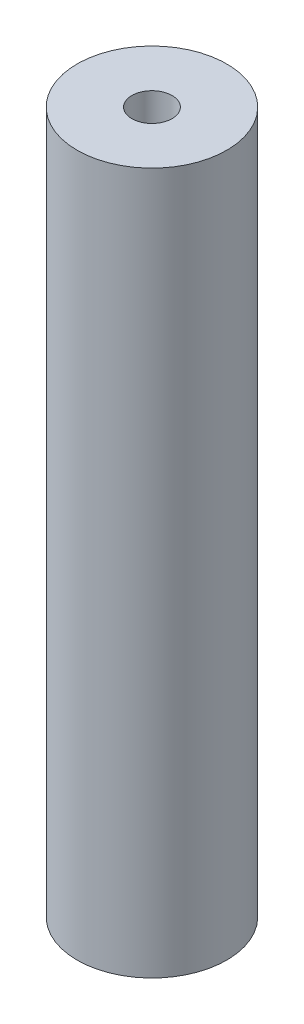
ISO-10303-21;
HEADER;
FILE_DESCRIPTION(('STEP AP214'),'2;1');
FILE_NAME('part.step','',(''),(''),'','','');
FILE_SCHEMA(('AUTOMOTIVE_DESIGN { 1 0 10303 214 1 1 1 1 }'));
ENDSEC;
DATA;
#1=APPLICATION_CONTEXT('core data for automotive mechanical design processes');
#2=APPLICATION_PROTOCOL_DEFINITION('international standard','automotive_design',2000,#1);
#3=PRODUCT_CONTEXT('',#1,'mechanical');
#4=PRODUCT('Part','Part','',(#3));
#5=PRODUCT_RELATED_PRODUCT_CATEGORY('part','',(#4));
#6=PRODUCT_DEFINITION_FORMATION('','',#4);
#7=PRODUCT_DEFINITION_CONTEXT('part definition',#1,'design');
#8=PRODUCT_DEFINITION('design','',#6,#7);
#9=PRODUCT_DEFINITION_SHAPE('','',#8);
#10=(LENGTH_UNIT() NAMED_UNIT(*) SI_UNIT(.MILLI.,.METRE.));
#11=(NAMED_UNIT(*) PLANE_ANGLE_UNIT() SI_UNIT($,.RADIAN.));
#12=(NAMED_UNIT(*) SI_UNIT($,.STERADIAN.) SOLID_ANGLE_UNIT());
#13=UNCERTAINTY_MEASURE_WITH_UNIT(LENGTH_MEASURE(1.E-05),#10,'distance_accuracy_value','');
#14=(GEOMETRIC_REPRESENTATION_CONTEXT(3) GLOBAL_UNCERTAINTY_ASSIGNED_CONTEXT((#13)) GLOBAL_UNIT_ASSIGNED_CONTEXT((#10,
#11,#12)) REPRESENTATION_CONTEXT('',''));
#15=CARTESIAN_POINT('',(0.,0.,0.));
#16=DIRECTION('',(0.,0.,1.));
#17=DIRECTION('',(1.,0.,0.));
#18=AXIS2_PLACEMENT_3D('',#15,#16,#17);
#19=CARTESIAN_POINT('',(0.,150.,0.));
#20=DIRECTION('',(0.,1.,0.));
#21=DIRECTION('',(0.,0.,1.));
#22=AXIS2_PLACEMENT_3D('',#19,#20,#21);
#23=PLANE('',#22);
#24=CARTESIAN_POINT('',(0.,150.,0.));
#25=DIRECTION('',(0.,1.,0.));
#26=DIRECTION('',(0.,0.,1.));
#27=AXIS2_PLACEMENT_3D('',#24,#25,#26);
#28=CIRCLE('',#27,16.);
#29=CARTESIAN_POINT('',(0.,150.,16.));
#30=VERTEX_POINT('',#29);
#31=EDGE_CURVE('E10',#30,#30,#28,.T.);
#32=ORIENTED_EDGE('',*,*,#31,.T.);
#33=EDGE_LOOP('',(#32));
#34=FACE_BOUND('',#33,.T.);
#35=CARTESIAN_POINT('',(0.,150.,0.));
#36=DIRECTION('',(0.,1.,0.));
#37=DIRECTION('',(0.,0.,1.));
#38=AXIS2_PLACEMENT_3D('',#35,#36,#37);
#39=CIRCLE('',#38,4.3);
#40=CARTESIAN_POINT('',(0.,150.,4.3));
#41=VERTEX_POINT('',#40);
#42=EDGE_CURVE('E48',#41,#41,#39,.T.);
#43=ORIENTED_EDGE('',*,*,#42,.F.);
#44=EDGE_LOOP('',(#43));
#45=FACE_BOUND('',#44,.T.);
#46=ADVANCED_FACE('F37',(#34,#45),#23,.T.);
#47=CARTESIAN_POINT('',(0.,0.,0.));
#48=DIRECTION('',(0.,1.,0.));
#49=DIRECTION('',(0.,0.,1.));
#50=AXIS2_PLACEMENT_3D('',#47,#48,#49);
#51=PLANE('',#50);
#52=CARTESIAN_POINT('',(0.,0.,0.));
#53=DIRECTION('',(0.,1.,0.));
#54=DIRECTION('',(0.,0.,1.));
#55=AXIS2_PLACEMENT_3D('',#52,#53,#54);
#56=CIRCLE('',#55,16.);
#57=CARTESIAN_POINT('',(0.,0.,16.));
#58=VERTEX_POINT('',#57);
#59=EDGE_CURVE('E41',#58,#58,#56,.T.);
#60=ORIENTED_EDGE('',*,*,#59,.F.);
#61=EDGE_LOOP('',(#60));
#62=FACE_BOUND('',#61,.T.);
#63=CARTESIAN_POINT('',(0.,0.,0.));
#64=DIRECTION('',(0.,1.,0.));
#65=DIRECTION('',(0.,0.,1.));
#66=AXIS2_PLACEMENT_3D('',#63,#64,#65);
#67=CIRCLE('',#66,4.3);
#68=CARTESIAN_POINT('',(0.,0.,4.3));
#69=VERTEX_POINT('',#68);
#70=EDGE_CURVE('E50',#69,#69,#67,.T.);
#71=ORIENTED_EDGE('',*,*,#70,.T.);
#72=EDGE_LOOP('',(#71));
#73=FACE_BOUND('',#72,.T.);
#74=ADVANCED_FACE('F60',(#62,#73),#51,.F.);
#75=CARTESIAN_POINT('',(0.,150.,0.));
#76=DIRECTION('',(0.,-1.,0.));
#77=DIRECTION('',(0.,0.,-1.));
#78=AXIS2_PLACEMENT_3D('',#75,#76,#77);
#79=CYLINDRICAL_SURFACE('',#78,16.);
#80=ORIENTED_EDGE('',*,*,#31,.F.);
#81=EDGE_LOOP('',(#80));
#82=FACE_BOUND('',#81,.T.);
#83=ORIENTED_EDGE('',*,*,#59,.T.);
#84=EDGE_LOOP('',(#83));
#85=FACE_BOUND('',#84,.T.);
#86=ADVANCED_FACE('F39',(#82,#85),#79,.T.);
#87=CARTESIAN_POINT('',(0.,150.,0.));
#88=DIRECTION('',(0.,-1.,0.));
#89=DIRECTION('',(0.,0.,-1.));
#90=AXIS2_PLACEMENT_3D('',#87,#88,#89);
#91=CYLINDRICAL_SURFACE('',#90,4.3);
#92=ORIENTED_EDGE('',*,*,#42,.T.);
#93=EDGE_LOOP('',(#92));
#94=FACE_BOUND('',#93,.T.);
#95=ORIENTED_EDGE('',*,*,#70,.F.);
#96=EDGE_LOOP('',(#95));
#97=FACE_BOUND('',#96,.T.);
#98=ADVANCED_FACE('F56',(#94,#97),#91,.F.);
#99=CLOSED_SHELL('',(#46,#74,#86,#98));
#100=MANIFOLD_SOLID_BREP('B2',#99);
#101=ADVANCED_BREP_SHAPE_REPRESENTATION('',(#18,#100),#14);
#102=SHAPE_DEFINITION_REPRESENTATION(#9,#101);
ENDSEC;
END-ISO-10303-21;
